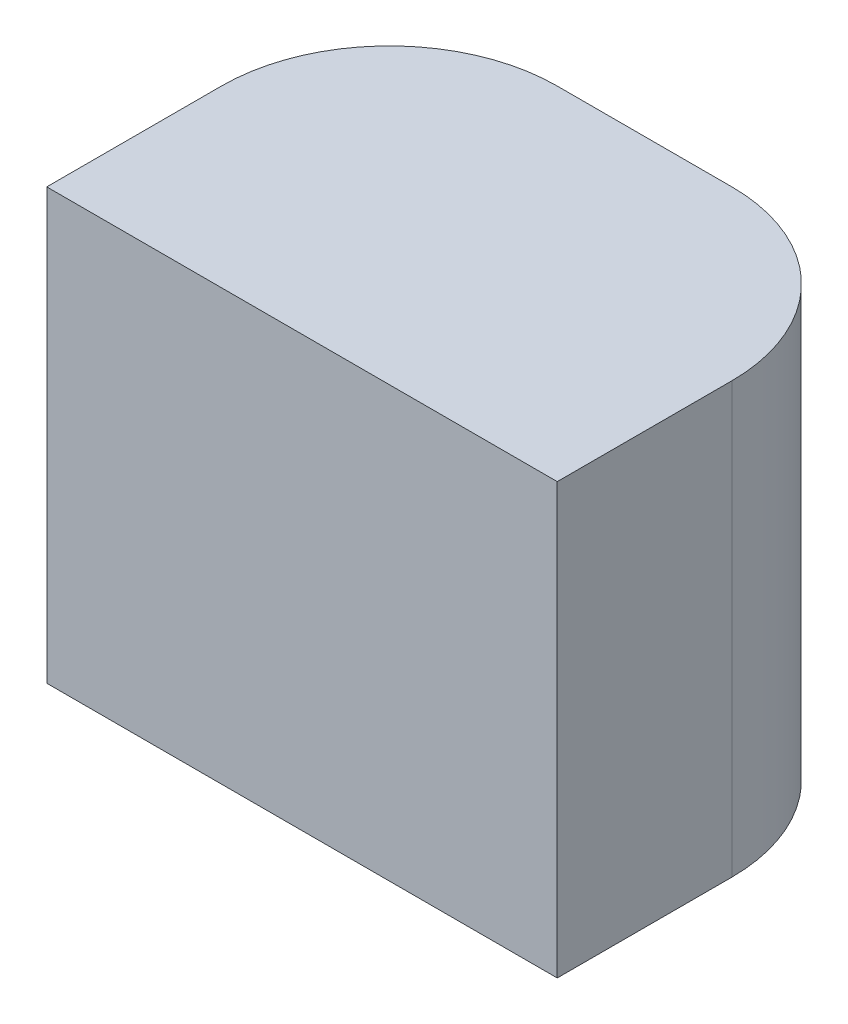
ISO-10303-21;
HEADER;
FILE_DESCRIPTION(('STEP AP214'),'2;1');
FILE_NAME('part.step','',(''),(''),'','','');
FILE_SCHEMA(('AUTOMOTIVE_DESIGN { 1 0 10303 214 1 1 1 1 }'));
ENDSEC;
DATA;
#1=APPLICATION_CONTEXT('core data for automotive mechanical design processes');
#2=APPLICATION_PROTOCOL_DEFINITION('international standard','automotive_design',2000,#1);
#3=PRODUCT_CONTEXT('',#1,'mechanical');
#4=PRODUCT('Part','Part','',(#3));
#5=PRODUCT_RELATED_PRODUCT_CATEGORY('part','',(#4));
#6=PRODUCT_DEFINITION_FORMATION('','',#4);
#7=PRODUCT_DEFINITION_CONTEXT('part definition',#1,'design');
#8=PRODUCT_DEFINITION('design','',#6,#7);
#9=PRODUCT_DEFINITION_SHAPE('','',#8);
#10=(LENGTH_UNIT() NAMED_UNIT(*) SI_UNIT(.MILLI.,.METRE.));
#11=(NAMED_UNIT(*) PLANE_ANGLE_UNIT() SI_UNIT($,.RADIAN.));
#12=(NAMED_UNIT(*) SI_UNIT($,.STERADIAN.) SOLID_ANGLE_UNIT());
#13=UNCERTAINTY_MEASURE_WITH_UNIT(LENGTH_MEASURE(1.E-05),#10,'distance_accuracy_value','');
#14=(GEOMETRIC_REPRESENTATION_CONTEXT(3) GLOBAL_UNCERTAINTY_ASSIGNED_CONTEXT((#13)) GLOBAL_UNIT_ASSIGNED_CONTEXT((#10,
#11,#12)) REPRESENTATION_CONTEXT('',''));
#15=CARTESIAN_POINT('',(0.,0.,0.));
#16=DIRECTION('',(0.,0.,1.));
#17=DIRECTION('',(1.,0.,0.));
#18=AXIS2_PLACEMENT_3D('',#15,#16,#17);
#19=CARTESIAN_POINT('',(-1.4,0.,-1.655));
#20=DIRECTION('',(0.,-1.,0.));
#21=DIRECTION('',(0.,0.,-1.));
#22=AXIS2_PLACEMENT_3D('',#19,#20,#21);
#23=CYLINDRICAL_SURFACE('',#22,0.25);
#24=CARTESIAN_POINT('',(-1.4,-0.64,-1.655));
#25=DIRECTION('',(0.,-1.,0.));
#26=DIRECTION('',(0.,0.,-1.));
#27=AXIS2_PLACEMENT_3D('',#24,#25,#26);
#28=CIRCLE('',#27,0.25);
#29=CARTESIAN_POINT('',(-1.65,-0.64,-1.655));
#30=VERTEX_POINT('',#29);
#31=CARTESIAN_POINT('',(-1.4,-0.64,-1.905));
#32=VERTEX_POINT('',#31);
#33=EDGE_CURVE('E11',#30,#32,#28,.T.);
#34=ORIENTED_EDGE('',*,*,#33,.F.);
#35=DIRECTION('',(0.,-1.,0.));
#36=VECTOR('',#35,1.);
#37=CARTESIAN_POINT('',(-1.65,0.,-1.655));
#38=LINE('',#37,#36);
#39=CARTESIAN_POINT('',(-1.65,0.,-1.655));
#40=VERTEX_POINT('',#39);
#41=EDGE_CURVE('E24',#40,#30,#38,.T.);
#42=ORIENTED_EDGE('',*,*,#41,.F.);
#43=CARTESIAN_POINT('',(-1.4,0.,-1.655));
#44=DIRECTION('',(0.,-1.,0.));
#45=DIRECTION('',(0.,0.,-1.));
#46=AXIS2_PLACEMENT_3D('',#43,#44,#45);
#47=CIRCLE('',#46,0.25);
#48=CARTESIAN_POINT('',(-1.4,0.,-1.905));
#49=VERTEX_POINT('',#48);
#50=EDGE_CURVE('E119',#40,#49,#47,.T.);
#51=ORIENTED_EDGE('',*,*,#50,.T.);
#52=DIRECTION('',(0.,-1.,0.));
#53=VECTOR('',#52,1.);
#54=CARTESIAN_POINT('',(-1.4,0.,-1.905));
#55=LINE('',#54,#53);
#56=EDGE_CURVE('E90',#49,#32,#55,.T.);
#57=ORIENTED_EDGE('',*,*,#56,.T.);
#58=EDGE_LOOP('',(#34,#42,#51,#57));
#59=FACE_BOUND('',#58,.T.);
#60=ADVANCED_FACE('F17',(#59),#23,.T.);
#61=CARTESIAN_POINT('',(-1.65,0.,-1.395));
#62=DIRECTION('',(-1.,0.,0.));
#63=DIRECTION('',(0.,0.,1.));
#64=AXIS2_PLACEMENT_3D('',#61,#62,#63);
#65=PLANE('',#64);
#66=DIRECTION('',(0.,0.,-1.));
#67=VECTOR('',#66,1.);
#68=CARTESIAN_POINT('',(-1.65,-0.64,-1.395));
#69=LINE('',#68,#67);
#70=CARTESIAN_POINT('',(-1.65,-0.64,-1.395));
#71=VERTEX_POINT('',#70);
#72=EDGE_CURVE('E116',#71,#30,#69,.T.);
#73=ORIENTED_EDGE('',*,*,#72,.F.);
#74=DIRECTION('',(0.,-1.,0.));
#75=VECTOR('',#74,1.);
#76=CARTESIAN_POINT('',(-1.65,0.,-1.395));
#77=LINE('',#76,#75);
#78=CARTESIAN_POINT('',(-1.65,0.,-1.395));
#79=VERTEX_POINT('',#78);
#80=EDGE_CURVE('E113',#79,#71,#77,.T.);
#81=ORIENTED_EDGE('',*,*,#80,.F.);
#82=DIRECTION('',(0.,0.,-1.));
#83=VECTOR('',#82,1.);
#84=CARTESIAN_POINT('',(-1.65,0.,-1.395));
#85=LINE('',#84,#83);
#86=EDGE_CURVE('E110',#79,#40,#85,.T.);
#87=ORIENTED_EDGE('',*,*,#86,.T.);
#88=ORIENTED_EDGE('',*,*,#41,.T.);
#89=EDGE_LOOP('',(#73,#81,#87,#88));
#90=FACE_BOUND('',#89,.T.);
#91=ADVANCED_FACE('F121',(#90),#65,.T.);
#92=CARTESIAN_POINT('',(-1.65,0.,-1.395));
#93=DIRECTION('',(0.,0.,1.));
#94=DIRECTION('',(1.,0.,0.));
#95=AXIS2_PLACEMENT_3D('',#92,#93,#94);
#96=PLANE('',#95);
#97=DIRECTION('',(-1.,0.,0.));
#98=VECTOR('',#97,1.);
#99=CARTESIAN_POINT('',(-1.65,-0.64,-1.395));
#100=LINE('',#99,#98);
#101=CARTESIAN_POINT('',(-0.89,-0.64,-1.395));
#102=VERTEX_POINT('',#101);
#103=EDGE_CURVE('E107',#102,#71,#100,.T.);
#104=ORIENTED_EDGE('',*,*,#103,.F.);
#105=DIRECTION('',(0.,-1.,0.));
#106=VECTOR('',#105,1.);
#107=CARTESIAN_POINT('',(-0.89,0.,-1.395));
#108=LINE('',#107,#106);
#109=CARTESIAN_POINT('',(-0.89,0.,-1.395));
#110=VERTEX_POINT('',#109);
#111=EDGE_CURVE('E104',#110,#102,#108,.T.);
#112=ORIENTED_EDGE('',*,*,#111,.F.);
#113=DIRECTION('',(-1.,0.,0.));
#114=VECTOR('',#113,1.);
#115=CARTESIAN_POINT('',(-1.65,0.,-1.395));
#116=LINE('',#115,#114);
#117=EDGE_CURVE('E101',#110,#79,#116,.T.);
#118=ORIENTED_EDGE('',*,*,#117,.T.);
#119=ORIENTED_EDGE('',*,*,#80,.T.);
#120=EDGE_LOOP('',(#104,#112,#118,#119));
#121=FACE_BOUND('',#120,.T.);
#122=ADVANCED_FACE('F125',(#121),#96,.T.);
#123=CARTESIAN_POINT('',(-0.89,0.,-1.395));
#124=DIRECTION('',(1.,0.,0.));
#125=DIRECTION('',(0.,0.,-1.));
#126=AXIS2_PLACEMENT_3D('',#123,#124,#125);
#127=PLANE('',#126);
#128=DIRECTION('',(0.,0.,1.));
#129=VECTOR('',#128,1.);
#130=CARTESIAN_POINT('',(-0.89,-0.64,-1.395));
#131=LINE('',#130,#129);
#132=CARTESIAN_POINT('',(-0.89,-0.64,-1.655));
#133=VERTEX_POINT('',#132);
#134=EDGE_CURVE('E98',#133,#102,#131,.T.);
#135=ORIENTED_EDGE('',*,*,#134,.F.);
#136=DIRECTION('',(0.,-1.,0.));
#137=VECTOR('',#136,1.);
#138=CARTESIAN_POINT('',(-0.89,0.,-1.655));
#139=LINE('',#138,#137);
#140=CARTESIAN_POINT('',(-0.89,0.,-1.655));
#141=VERTEX_POINT('',#140);
#142=EDGE_CURVE('E96',#141,#133,#139,.T.);
#143=ORIENTED_EDGE('',*,*,#142,.F.);
#144=DIRECTION('',(0.,0.,1.));
#145=VECTOR('',#144,1.);
#146=CARTESIAN_POINT('',(-0.89,0.,-1.395));
#147=LINE('',#146,#145);
#148=EDGE_CURVE('E85',#141,#110,#147,.T.);
#149=ORIENTED_EDGE('',*,*,#148,.T.);
#150=ORIENTED_EDGE('',*,*,#111,.T.);
#151=EDGE_LOOP('',(#135,#143,#149,#150));
#152=FACE_BOUND('',#151,.T.);
#153=ADVANCED_FACE('F127',(#152),#127,.T.);
#154=CARTESIAN_POINT('',(-1.14,0.,-1.655));
#155=DIRECTION('',(0.,-1.,0.));
#156=DIRECTION('',(0.,0.,-1.));
#157=AXIS2_PLACEMENT_3D('',#154,#155,#156);
#158=CYLINDRICAL_SURFACE('',#157,0.25);
#159=CARTESIAN_POINT('',(-1.14,-0.64,-1.655));
#160=DIRECTION('',(0.,-1.,0.));
#161=DIRECTION('',(0.,0.,-1.));
#162=AXIS2_PLACEMENT_3D('',#159,#160,#161);
#163=CIRCLE('',#162,0.25);
#164=CARTESIAN_POINT('',(-1.14,-0.64,-1.905));
#165=VERTEX_POINT('',#164);
#166=EDGE_CURVE('E72',#165,#133,#163,.T.);
#167=ORIENTED_EDGE('',*,*,#166,.F.);
#168=DIRECTION('',(0.,-1.,0.));
#169=VECTOR('',#168,1.);
#170=CARTESIAN_POINT('',(-1.14,0.,-1.905));
#171=LINE('',#170,#169);
#172=CARTESIAN_POINT('',(-1.14,0.,-1.905));
#173=VERTEX_POINT('',#172);
#174=EDGE_CURVE('E66',#173,#165,#171,.T.);
#175=ORIENTED_EDGE('',*,*,#174,.F.);
#176=CARTESIAN_POINT('',(-1.14,0.,-1.655));
#177=DIRECTION('',(0.,-1.,0.));
#178=DIRECTION('',(0.,0.,-1.));
#179=AXIS2_PLACEMENT_3D('',#176,#177,#178);
#180=CIRCLE('',#179,0.25);
#181=EDGE_CURVE('E70',#173,#141,#180,.T.);
#182=ORIENTED_EDGE('',*,*,#181,.T.);
#183=ORIENTED_EDGE('',*,*,#142,.T.);
#184=EDGE_LOOP('',(#167,#175,#182,#183));
#185=FACE_BOUND('',#184,.T.);
#186=ADVANCED_FACE('F68',(#185),#158,.T.);
#187=CARTESIAN_POINT('',(-1.4,0.,-1.905));
#188=DIRECTION('',(0.,0.,-1.));
#189=DIRECTION('',(-1.,0.,0.));
#190=AXIS2_PLACEMENT_3D('',#187,#188,#189);
#191=PLANE('',#190);
#192=DIRECTION('',(1.,0.,0.));
#193=VECTOR('',#192,1.);
#194=CARTESIAN_POINT('',(-1.4,-0.64,-1.905));
#195=LINE('',#194,#193);
#196=EDGE_CURVE('E86',#32,#165,#195,.T.);
#197=ORIENTED_EDGE('',*,*,#196,.F.);
#198=ORIENTED_EDGE('',*,*,#56,.F.);
#199=DIRECTION('',(1.,0.,0.));
#200=VECTOR('',#199,1.);
#201=CARTESIAN_POINT('',(-1.4,0.,-1.905));
#202=LINE('',#201,#200);
#203=EDGE_CURVE('E82',#49,#173,#202,.T.);
#204=ORIENTED_EDGE('',*,*,#203,.T.);
#205=ORIENTED_EDGE('',*,*,#174,.T.);
#206=EDGE_LOOP('',(#197,#198,#204,#205));
#207=FACE_BOUND('',#206,.T.);
#208=ADVANCED_FACE('F89',(#207),#191,.T.);
#209=CARTESIAN_POINT('',(-1.4,0.,-1.655));
#210=DIRECTION('',(0.,-1.,0.));
#211=DIRECTION('',(0.,0.,-1.));
#212=AXIS2_PLACEMENT_3D('',#209,#210,#211);
#213=PLANE('',#212);
#214=ORIENTED_EDGE('',*,*,#50,.F.);
#215=ORIENTED_EDGE('',*,*,#86,.F.);
#216=ORIENTED_EDGE('',*,*,#117,.F.);
#217=ORIENTED_EDGE('',*,*,#148,.F.);
#218=ORIENTED_EDGE('',*,*,#181,.F.);
#219=ORIENTED_EDGE('',*,*,#203,.F.);
#220=EDGE_LOOP('',(#214,#215,#216,#217,#218,#219));
#221=FACE_BOUND('',#220,.T.);
#222=ADVANCED_FACE('F81',(#221),#213,.F.);
#223=CARTESIAN_POINT('',(-1.4,-0.64,-1.655));
#224=DIRECTION('',(0.,-1.,0.));
#225=DIRECTION('',(0.,0.,-1.));
#226=AXIS2_PLACEMENT_3D('',#223,#224,#225);
#227=PLANE('',#226);
#228=ORIENTED_EDGE('',*,*,#33,.T.);
#229=ORIENTED_EDGE('',*,*,#196,.T.);
#230=ORIENTED_EDGE('',*,*,#166,.T.);
#231=ORIENTED_EDGE('',*,*,#134,.T.);
#232=ORIENTED_EDGE('',*,*,#103,.T.);
#233=ORIENTED_EDGE('',*,*,#72,.T.);
#234=EDGE_LOOP('',(#228,#229,#230,#231,#232,#233));
#235=FACE_BOUND('',#234,.T.);
#236=ADVANCED_FACE('F123',(#235),#227,.T.);
#237=CLOSED_SHELL('',(#60,#91,#122,#153,#186,#208,#222,#236));
#238=MANIFOLD_SOLID_BREP('B1',#237);
#239=ADVANCED_BREP_SHAPE_REPRESENTATION('',(#18,#238),#14);
#240=SHAPE_DEFINITION_REPRESENTATION(#9,#239);
ENDSEC;
END-ISO-10303-21;
